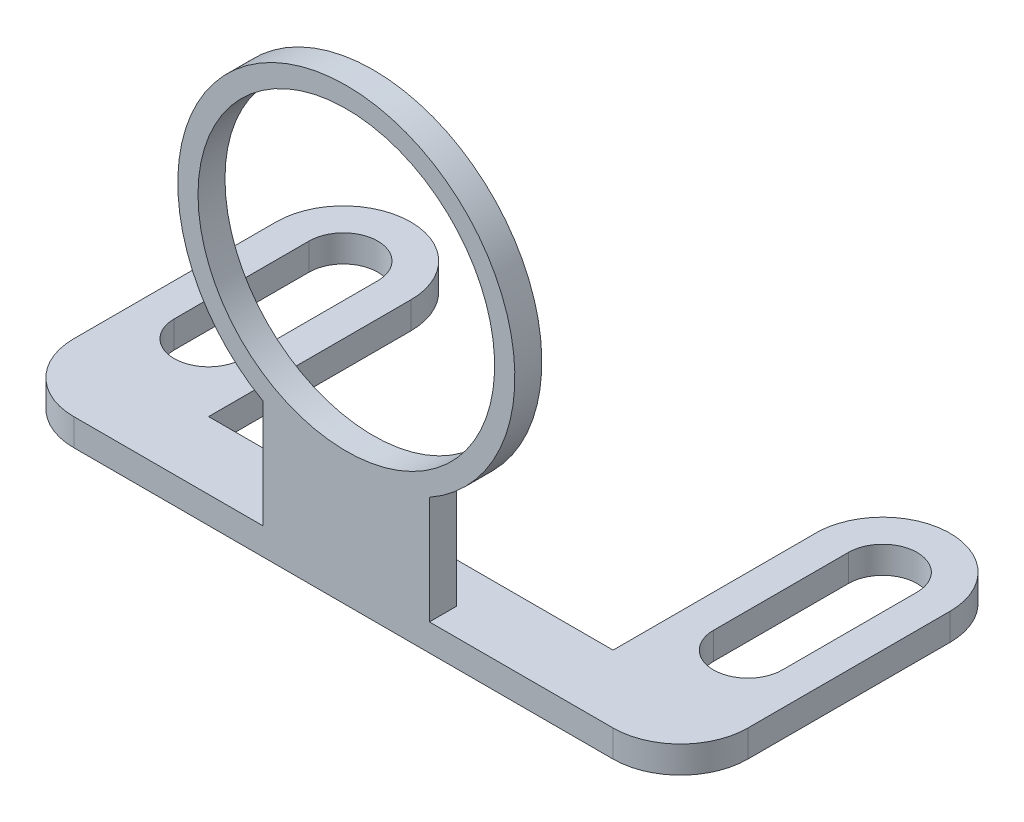
ISO-10303-21;
HEADER;
FILE_DESCRIPTION(('STEP AP214'),'2;1');
FILE_NAME('part.step','',(''),(''),'','','');
FILE_SCHEMA(('AUTOMOTIVE_DESIGN { 1 0 10303 214 1 1 1 1 }'));
ENDSEC;
DATA;
#1=APPLICATION_CONTEXT('core data for automotive mechanical design processes');
#2=APPLICATION_PROTOCOL_DEFINITION('international standard','automotive_design',2000,#1);
#3=PRODUCT_CONTEXT('',#1,'mechanical');
#4=PRODUCT('Part','Part','',(#3));
#5=PRODUCT_RELATED_PRODUCT_CATEGORY('part','',(#4));
#6=PRODUCT_DEFINITION_FORMATION('','',#4);
#7=PRODUCT_DEFINITION_CONTEXT('part definition',#1,'design');
#8=PRODUCT_DEFINITION('design','',#6,#7);
#9=PRODUCT_DEFINITION_SHAPE('','',#8);
#10=(LENGTH_UNIT() NAMED_UNIT(*) SI_UNIT(.MILLI.,.METRE.));
#11=(NAMED_UNIT(*) PLANE_ANGLE_UNIT() SI_UNIT($,.RADIAN.));
#12=(NAMED_UNIT(*) SI_UNIT($,.STERADIAN.) SOLID_ANGLE_UNIT());
#13=UNCERTAINTY_MEASURE_WITH_UNIT(LENGTH_MEASURE(1.E-05),#10,'distance_accuracy_value','');
#14=(GEOMETRIC_REPRESENTATION_CONTEXT(3) GLOBAL_UNCERTAINTY_ASSIGNED_CONTEXT((#13)) GLOBAL_UNIT_ASSIGNED_CONTEXT((#10,
#11,#12)) REPRESENTATION_CONTEXT('',''));
#15=CARTESIAN_POINT('',(0.,0.,0.));
#16=DIRECTION('',(0.,0.,1.));
#17=DIRECTION('',(1.,0.,0.));
#18=AXIS2_PLACEMENT_3D('',#15,#16,#17);
#19=CARTESIAN_POINT('',(-3.12539217756724,2.,0.));
#20=DIRECTION('',(1.,0.,0.));
#21=DIRECTION('',(0.,0.,-1.));
#22=AXIS2_PLACEMENT_3D('',#19,#20,#21);
#23=PLANE('',#22);
#24=DIRECTION('',(0.,0.,1.));
#25=VECTOR('',#24,1.);
#26=CARTESIAN_POINT('',(-3.12539217756724,0.,0.));
#27=LINE('',#26,#25);
#28=CARTESIAN_POINT('',(-3.12539217756726,0.,-25.));
#29=VERTEX_POINT('',#28);
#30=CARTESIAN_POINT('',(-3.12539217756725,0.,-15.));
#31=VERTEX_POINT('',#30);
#32=EDGE_CURVE('E247',#29,#31,#27,.T.);
#33=ORIENTED_EDGE('',*,*,#32,.T.);
#34=DIRECTION('',(0.,-1.,0.));
#35=VECTOR('',#34,1.);
#36=CARTESIAN_POINT('',(-3.12539217756725,2.,-15.));
#37=LINE('',#36,#35);
#38=CARTESIAN_POINT('',(-3.12539217756725,2.,-15.));
#39=VERTEX_POINT('',#38);
#40=EDGE_CURVE('E11',#39,#31,#37,.T.);
#41=ORIENTED_EDGE('',*,*,#40,.F.);
#42=DIRECTION('',(0.,0.,1.));
#43=VECTOR('',#42,1.);
#44=CARTESIAN_POINT('',(-3.12539217756724,2.,0.));
#45=LINE('',#44,#43);
#46=CARTESIAN_POINT('',(-3.12539217756726,2.,-25.));
#47=VERTEX_POINT('',#46);
#48=EDGE_CURVE('E186',#47,#39,#45,.T.);
#49=ORIENTED_EDGE('',*,*,#48,.F.);
#50=DIRECTION('',(0.,-1.,0.));
#51=VECTOR('',#50,1.);
#52=CARTESIAN_POINT('',(-3.12539217756726,2.,-25.));
#53=LINE('',#52,#51);
#54=EDGE_CURVE('E255',#47,#29,#53,.T.);
#55=ORIENTED_EDGE('',*,*,#54,.T.);
#56=EDGE_LOOP('',(#33,#41,#49,#55));
#57=FACE_BOUND('',#56,.T.);
#58=ADVANCED_FACE('F36',(#57),#23,.F.);
#59=CARTESIAN_POINT('',(-5.67539217756725,2.,-15.));
#60=DIRECTION('',(0.,-1.,0.));
#61=DIRECTION('',(0.,0.,-1.));
#62=AXIS2_PLACEMENT_3D('',#59,#60,#61);
#63=CYLINDRICAL_SURFACE('',#62,2.55);
#64=CARTESIAN_POINT('',(-5.67539217756725,0.,-15.));
#65=DIRECTION('',(0.,1.,0.));
#66=DIRECTION('',(0.,0.,1.));
#67=AXIS2_PLACEMENT_3D('',#64,#65,#66);
#68=CIRCLE('',#67,2.55);
#69=CARTESIAN_POINT('',(-8.22539217756726,0.,-15.));
#70=VERTEX_POINT('',#69);
#71=EDGE_CURVE('E192',#31,#70,#68,.F.);
#72=ORIENTED_EDGE('',*,*,#71,.T.);
#73=DIRECTION('',(0.,-1.,0.));
#74=VECTOR('',#73,1.);
#75=CARTESIAN_POINT('',(-8.22539217756726,2.,-15.));
#76=LINE('',#75,#74);
#77=CARTESIAN_POINT('',(-8.22539217756726,2.,-15.));
#78=VERTEX_POINT('',#77);
#79=EDGE_CURVE('E45',#78,#70,#76,.T.);
#80=ORIENTED_EDGE('',*,*,#79,.F.);
#81=CARTESIAN_POINT('',(-5.67539217756725,2.,-15.));
#82=DIRECTION('',(0.,1.,0.));
#83=DIRECTION('',(0.,0.,1.));
#84=AXIS2_PLACEMENT_3D('',#81,#82,#83);
#85=CIRCLE('',#84,2.55);
#86=EDGE_CURVE('E180',#39,#78,#85,.F.);
#87=ORIENTED_EDGE('',*,*,#86,.F.);
#88=ORIENTED_EDGE('',*,*,#40,.T.);
#89=EDGE_LOOP('',(#72,#80,#87,#88));
#90=FACE_BOUND('',#89,.T.);
#91=ADVANCED_FACE('F191',(#90),#63,.F.);
#92=CARTESIAN_POINT('',(-8.22539217756725,2.,0.));
#93=DIRECTION('',(1.,0.,0.));
#94=DIRECTION('',(0.,0.,-1.));
#95=AXIS2_PLACEMENT_3D('',#92,#93,#94);
#96=PLANE('',#95);
#97=DIRECTION('',(0.,0.,1.));
#98=VECTOR('',#97,1.);
#99=CARTESIAN_POINT('',(-8.22539217756725,0.,0.));
#100=LINE('',#99,#98);
#101=CARTESIAN_POINT('',(-8.22539217756727,0.,-25.));
#102=VERTEX_POINT('',#101);
#103=EDGE_CURVE('E251',#102,#70,#100,.T.);
#104=ORIENTED_EDGE('',*,*,#103,.F.);
#105=DIRECTION('',(0.,-1.,0.));
#106=VECTOR('',#105,1.);
#107=CARTESIAN_POINT('',(-8.22539217756727,2.,-25.));
#108=LINE('',#107,#106);
#109=CARTESIAN_POINT('',(-8.22539217756727,2.,-25.));
#110=VERTEX_POINT('',#109);
#111=EDGE_CURVE('E196',#110,#102,#108,.T.);
#112=ORIENTED_EDGE('',*,*,#111,.F.);
#113=DIRECTION('',(0.,0.,1.));
#114=VECTOR('',#113,1.);
#115=CARTESIAN_POINT('',(-8.22539217756725,2.,0.));
#116=LINE('',#115,#114);
#117=EDGE_CURVE('E184',#110,#78,#116,.T.);
#118=ORIENTED_EDGE('',*,*,#117,.T.);
#119=ORIENTED_EDGE('',*,*,#79,.T.);
#120=EDGE_LOOP('',(#104,#112,#118,#119));
#121=FACE_BOUND('',#120,.T.);
#122=ADVANCED_FACE('F198',(#121),#96,.T.);
#123=CARTESIAN_POINT('',(-45.6753921775673,2.,-15.));
#124=DIRECTION('',(0.,-1.,0.));
#125=DIRECTION('',(0.,0.,-1.));
#126=AXIS2_PLACEMENT_3D('',#123,#124,#125);
#127=CYLINDRICAL_SURFACE('',#126,2.55);
#128=CARTESIAN_POINT('',(-45.6753921775673,0.,-15.));
#129=DIRECTION('',(0.,1.,0.));
#130=DIRECTION('',(0.,0.,1.));
#131=AXIS2_PLACEMENT_3D('',#128,#129,#130);
#132=CIRCLE('',#131,2.55);
#133=CARTESIAN_POINT('',(-48.2253921775673,0.,-15.));
#134=VERTEX_POINT('',#133);
#135=CARTESIAN_POINT('',(-43.1253921775673,0.,-15.));
#136=VERTEX_POINT('',#135);
#137=EDGE_CURVE('E235',#134,#136,#132,.T.);
#138=ORIENTED_EDGE('',*,*,#137,.F.);
#139=DIRECTION('',(0.,-1.,0.));
#140=VECTOR('',#139,1.);
#141=CARTESIAN_POINT('',(-48.2253921775673,2.,-15.));
#142=LINE('',#141,#140);
#143=CARTESIAN_POINT('',(-48.2253921775673,2.,-15.));
#144=VERTEX_POINT('',#143);
#145=EDGE_CURVE('E257',#144,#134,#142,.T.);
#146=ORIENTED_EDGE('',*,*,#145,.F.);
#147=CARTESIAN_POINT('',(-45.6753921775673,2.,-15.));
#148=DIRECTION('',(0.,1.,0.));
#149=DIRECTION('',(0.,0.,1.));
#150=AXIS2_PLACEMENT_3D('',#147,#148,#149);
#151=CIRCLE('',#150,2.55);
#152=CARTESIAN_POINT('',(-43.1253921775673,2.,-15.));
#153=VERTEX_POINT('',#152);
#154=EDGE_CURVE('E317',#144,#153,#151,.T.);
#155=ORIENTED_EDGE('',*,*,#154,.T.);
#156=DIRECTION('',(0.,-1.,0.));
#157=VECTOR('',#156,1.);
#158=CARTESIAN_POINT('',(-43.1253921775673,2.,-15.));
#159=LINE('',#158,#157);
#160=EDGE_CURVE('E259',#153,#136,#159,.T.);
#161=ORIENTED_EDGE('',*,*,#160,.T.);
#162=EDGE_LOOP('',(#138,#146,#155,#161));
#163=FACE_BOUND('',#162,.T.);
#164=ADVANCED_FACE('F338',(#163),#127,.F.);
#165=CARTESIAN_POINT('',(-48.2253921775673,2.,0.));
#166=DIRECTION('',(1.,0.,0.));
#167=DIRECTION('',(0.,0.,-1.));
#168=AXIS2_PLACEMENT_3D('',#165,#166,#167);
#169=PLANE('',#168);
#170=DIRECTION('',(0.,0.,1.));
#171=VECTOR('',#170,1.);
#172=CARTESIAN_POINT('',(-48.2253921775673,0.,0.));
#173=LINE('',#172,#171);
#174=CARTESIAN_POINT('',(-48.2253921775673,0.,-25.));
#175=VERTEX_POINT('',#174);
#176=EDGE_CURVE('E238',#175,#134,#173,.T.);
#177=ORIENTED_EDGE('',*,*,#176,.F.);
#178=DIRECTION('',(0.,-1.,0.));
#179=VECTOR('',#178,1.);
#180=CARTESIAN_POINT('',(-48.2253921775673,2.,-25.));
#181=LINE('',#180,#179);
#182=CARTESIAN_POINT('',(-48.2253921775673,2.,-25.));
#183=VERTEX_POINT('',#182);
#184=EDGE_CURVE('E264',#183,#175,#181,.T.);
#185=ORIENTED_EDGE('',*,*,#184,.F.);
#186=DIRECTION('',(0.,0.,1.));
#187=VECTOR('',#186,1.);
#188=CARTESIAN_POINT('',(-48.2253921775673,2.,0.));
#189=LINE('',#188,#187);
#190=EDGE_CURVE('E320',#183,#144,#189,.T.);
#191=ORIENTED_EDGE('',*,*,#190,.T.);
#192=ORIENTED_EDGE('',*,*,#145,.T.);
#193=EDGE_LOOP('',(#177,#185,#191,#192));
#194=FACE_BOUND('',#193,.T.);
#195=ADVANCED_FACE('F341',(#194),#169,.T.);
#196=CARTESIAN_POINT('',(-45.6753921775673,2.,-25.));
#197=DIRECTION('',(0.,-1.,0.));
#198=DIRECTION('',(0.,0.,-1.));
#199=AXIS2_PLACEMENT_3D('',#196,#197,#198);
#200=CYLINDRICAL_SURFACE('',#199,2.55);
#201=CARTESIAN_POINT('',(-45.6753921775673,0.,-25.));
#202=DIRECTION('',(0.,1.,0.));
#203=DIRECTION('',(0.,0.,1.));
#204=AXIS2_PLACEMENT_3D('',#201,#202,#203);
#205=CIRCLE('',#204,2.55);
#206=CARTESIAN_POINT('',(-43.1253921775673,0.,-25.));
#207=VERTEX_POINT('',#206);
#208=EDGE_CURVE('E241',#207,#175,#205,.T.);
#209=ORIENTED_EDGE('',*,*,#208,.F.);
#210=DIRECTION('',(0.,-1.,0.));
#211=VECTOR('',#210,1.);
#212=CARTESIAN_POINT('',(-43.1253921775673,2.,-25.));
#213=LINE('',#212,#211);
#214=CARTESIAN_POINT('',(-43.1253921775673,2.,-25.));
#215=VERTEX_POINT('',#214);
#216=EDGE_CURVE('E261',#215,#207,#213,.T.);
#217=ORIENTED_EDGE('',*,*,#216,.F.);
#218=CARTESIAN_POINT('',(-45.6753921775673,2.,-25.));
#219=DIRECTION('',(0.,1.,0.));
#220=DIRECTION('',(0.,0.,1.));
#221=AXIS2_PLACEMENT_3D('',#218,#219,#220);
#222=CIRCLE('',#221,2.55);
#223=EDGE_CURVE('E323',#215,#183,#222,.T.);
#224=ORIENTED_EDGE('',*,*,#223,.T.);
#225=ORIENTED_EDGE('',*,*,#184,.T.);
#226=EDGE_LOOP('',(#209,#217,#224,#225));
#227=FACE_BOUND('',#226,.T.);
#228=ADVANCED_FACE('F344',(#227),#200,.F.);
#229=CARTESIAN_POINT('',(-45.6753921775673,2.,-9.99999999999999));
#230=DIRECTION('',(0.,-1.,0.));
#231=DIRECTION('',(0.,0.,-1.));
#232=AXIS2_PLACEMENT_3D('',#229,#230,#231);
#233=CYLINDRICAL_SURFACE('',#232,5.);
#234=CARTESIAN_POINT('',(-45.6753921775673,0.,-9.99999999999999));
#235=DIRECTION('',(0.,1.,0.));
#236=DIRECTION('',(0.,0.,1.));
#237=AXIS2_PLACEMENT_3D('',#234,#235,#236);
#238=CIRCLE('',#237,5.);
#239=CARTESIAN_POINT('',(-45.6753921775673,0.,-4.99999999999999));
#240=VERTEX_POINT('',#239);
#241=CARTESIAN_POINT('',(-50.6753921775673,0.,-9.99999999999999));
#242=VERTEX_POINT('',#241);
#243=EDGE_CURVE('E204',#240,#242,#238,.F.);
#244=ORIENTED_EDGE('',*,*,#243,.F.);
#245=DIRECTION('',(0.,-1.,0.));
#246=VECTOR('',#245,1.);
#247=CARTESIAN_POINT('',(-45.6753921775673,2.,-4.99999999999999));
#248=LINE('',#247,#246);
#249=CARTESIAN_POINT('',(-45.6753921775673,2.,-4.99999999999999));
#250=VERTEX_POINT('',#249);
#251=EDGE_CURVE('E262',#250,#240,#248,.T.);
#252=ORIENTED_EDGE('',*,*,#251,.F.);
#253=CARTESIAN_POINT('',(-45.6753921775673,2.,-9.99999999999999));
#254=DIRECTION('',(0.,1.,0.));
#255=DIRECTION('',(0.,0.,1.));
#256=AXIS2_PLACEMENT_3D('',#253,#254,#255);
#257=CIRCLE('',#256,5.);
#258=CARTESIAN_POINT('',(-50.6753921775673,2.,-9.99999999999999));
#259=VERTEX_POINT('',#258);
#260=EDGE_CURVE('E254',#250,#259,#257,.F.);
#261=ORIENTED_EDGE('',*,*,#260,.T.);
#262=DIRECTION('',(0.,-1.,0.));
#263=VECTOR('',#262,1.);
#264=CARTESIAN_POINT('',(-50.6753921775673,2.,-9.99999999999999));
#265=LINE('',#264,#263);
#266=EDGE_CURVE('E200',#259,#242,#265,.T.);
#267=ORIENTED_EDGE('',*,*,#266,.T.);
#268=EDGE_LOOP('',(#244,#252,#261,#267));
#269=FACE_BOUND('',#268,.T.);
#270=ADVANCED_FACE('F38',(#269),#233,.T.);
#271=CARTESIAN_POINT('',(0.,2.,-5.));
#272=DIRECTION('',(0.,0.,1.));
#273=DIRECTION('',(1.,0.,0.));
#274=AXIS2_PLACEMENT_3D('',#271,#272,#273);
#275=PLANE('',#274);
#276=DIRECTION('',(-1.,0.,0.));
#277=VECTOR('',#276,1.);
#278=CARTESIAN_POINT('',(0.,0.,-5.));
#279=LINE('',#278,#277);
#280=CARTESIAN_POINT('',(-5.67539217756727,0.,-5.));
#281=VERTEX_POINT('',#280);
#282=EDGE_CURVE('E207',#281,#240,#279,.T.);
#283=ORIENTED_EDGE('',*,*,#282,.F.);
#284=DIRECTION('',(0.,-1.,0.));
#285=VECTOR('',#284,1.);
#286=CARTESIAN_POINT('',(-5.67539217756727,2.,-5.));
#287=LINE('',#286,#285);
#288=CARTESIAN_POINT('',(-5.67539217756727,2.,-5.));
#289=VERTEX_POINT('',#288);
#290=EDGE_CURVE('E282',#289,#281,#287,.T.);
#291=ORIENTED_EDGE('',*,*,#290,.F.);
#292=DIRECTION('',(-1.,0.,0.));
#293=VECTOR('',#292,1.);
#294=CARTESIAN_POINT('',(0.,2.,-5.));
#295=LINE('',#294,#293);
#296=CARTESIAN_POINT('',(-19.2970374134388,2.,-5.));
#297=VERTEX_POINT('',#296);
#298=EDGE_CURVE('E285',#289,#297,#295,.T.);
#299=ORIENTED_EDGE('',*,*,#298,.T.);
#300=DIRECTION('',(0.,-1.,0.));
#301=VECTOR('',#300,1.);
#302=CARTESIAN_POINT('',(-19.2970374134388,10.004378208322,-5.));
#303=LINE('',#302,#301);
#304=CARTESIAN_POINT('',(-19.2970374134388,10.004378208322,-5.));
#305=VERTEX_POINT('',#304);
#306=EDGE_CURVE('E53',#305,#297,#303,.T.);
#307=ORIENTED_EDGE('',*,*,#306,.F.);
#308=CARTESIAN_POINT('',(-25.4596945631998,20.8796555314297,-5.));
#309=DIRECTION('',(0.,0.,-1.));
#310=DIRECTION('',(-1.,0.,0.));
#311=AXIS2_PLACEMENT_3D('',#308,#309,#310);
#312=CIRCLE('',#311,12.5);
#313=CARTESIAN_POINT('',(-31.6223517129608,10.004378208322,-5.));
#314=VERTEX_POINT('',#313);
#315=EDGE_CURVE('E424',#314,#305,#312,.T.);
#316=ORIENTED_EDGE('',*,*,#315,.F.);
#317=DIRECTION('',(0.,1.,0.));
#318=VECTOR('',#317,1.);
#319=CARTESIAN_POINT('',(-31.6223517129608,10.004378208322,-5.));
#320=LINE('',#319,#318);
#321=CARTESIAN_POINT('',(-31.6223517129608,2.,-5.));
#322=VERTEX_POINT('',#321);
#323=EDGE_CURVE('E431',#322,#314,#320,.T.);
#324=ORIENTED_EDGE('',*,*,#323,.F.);
#325=EDGE_CURVE('E133',#322,#250,#295,.T.);
#326=ORIENTED_EDGE('',*,*,#325,.T.);
#327=ORIENTED_EDGE('',*,*,#251,.T.);
#328=EDGE_LOOP('',(#283,#291,#299,#307,#316,#324,#326,#327));
#329=FACE_BOUND('',#328,.T.);
#330=CARTESIAN_POINT('',(-25.4596945631998,20.8796555314297,-5.));
#331=DIRECTION('',(0.,0.,-1.));
#332=DIRECTION('',(-1.,0.,0.));
#333=AXIS2_PLACEMENT_3D('',#330,#331,#332);
#334=CIRCLE('',#333,11.);
#335=CARTESIAN_POINT('',(-36.4596945631998,20.8796555314297,-5.));
#336=VERTEX_POINT('',#335);
#337=EDGE_CURVE('E419',#336,#336,#334,.T.);
#338=ORIENTED_EDGE('',*,*,#337,.T.);
#339=EDGE_LOOP('',(#338));
#340=FACE_BOUND('',#339,.T.);
#341=ADVANCED_FACE('F408',(#329,#340),#275,.T.);
#342=CARTESIAN_POINT('',(-5.67539217756727,2.,-10.));
#343=DIRECTION('',(0.,-1.,0.));
#344=DIRECTION('',(0.,0.,-1.));
#345=AXIS2_PLACEMENT_3D('',#342,#343,#344);
#346=CYLINDRICAL_SURFACE('',#345,5.);
#347=CARTESIAN_POINT('',(-5.67539217756727,0.,-10.));
#348=DIRECTION('',(0.,1.,0.));
#349=DIRECTION('',(0.,0.,1.));
#350=AXIS2_PLACEMENT_3D('',#347,#348,#349);
#351=CIRCLE('',#350,5.);
#352=CARTESIAN_POINT('',(-0.675392177567271,0.,-10.));
#353=VERTEX_POINT('',#352);
#354=EDGE_CURVE('E211',#353,#281,#351,.F.);
#355=ORIENTED_EDGE('',*,*,#354,.F.);
#356=DIRECTION('',(0.,-1.,0.));
#357=VECTOR('',#356,1.);
#358=CARTESIAN_POINT('',(-0.675392177567271,2.,-10.));
#359=LINE('',#358,#357);
#360=CARTESIAN_POINT('',(-0.675392177567271,2.,-10.));
#361=VERTEX_POINT('',#360);
#362=EDGE_CURVE('E280',#361,#353,#359,.T.);
#363=ORIENTED_EDGE('',*,*,#362,.F.);
#364=CARTESIAN_POINT('',(-5.67539217756727,2.,-10.));
#365=DIRECTION('',(0.,1.,0.));
#366=DIRECTION('',(0.,0.,1.));
#367=AXIS2_PLACEMENT_3D('',#364,#365,#366);
#368=CIRCLE('',#367,5.);
#369=EDGE_CURVE('E289',#361,#289,#368,.F.);
#370=ORIENTED_EDGE('',*,*,#369,.T.);
#371=ORIENTED_EDGE('',*,*,#290,.T.);
#372=EDGE_LOOP('',(#355,#363,#370,#371));
#373=FACE_BOUND('',#372,.T.);
#374=ADVANCED_FACE('F405',(#373),#346,.T.);
#375=CARTESIAN_POINT('',(-0.67539217756727,2.,0.));
#376=DIRECTION('',(1.,0.,0.));
#377=DIRECTION('',(0.,0.,-1.));
#378=AXIS2_PLACEMENT_3D('',#375,#376,#377);
#379=PLANE('',#378);
#380=DIRECTION('',(0.,0.,1.));
#381=VECTOR('',#380,1.);
#382=CARTESIAN_POINT('',(-0.67539217756727,0.,0.));
#383=LINE('',#382,#381);
#384=CARTESIAN_POINT('',(-0.675392177567273,0.,-25.));
#385=VERTEX_POINT('',#384);
#386=EDGE_CURVE('E214',#385,#353,#383,.T.);
#387=ORIENTED_EDGE('',*,*,#386,.F.);
#388=DIRECTION('',(0.,-1.,0.));
#389=VECTOR('',#388,1.);
#390=CARTESIAN_POINT('',(-0.675392177567273,2.,-25.));
#391=LINE('',#390,#389);
#392=CARTESIAN_POINT('',(-0.675392177567273,2.,-25.));
#393=VERTEX_POINT('',#392);
#394=EDGE_CURVE('E278',#393,#385,#391,.T.);
#395=ORIENTED_EDGE('',*,*,#394,.F.);
#396=DIRECTION('',(0.,0.,1.));
#397=VECTOR('',#396,1.);
#398=CARTESIAN_POINT('',(-0.67539217756727,2.,0.));
#399=LINE('',#398,#397);
#400=EDGE_CURVE('E298',#393,#361,#399,.T.);
#401=ORIENTED_EDGE('',*,*,#400,.T.);
#402=ORIENTED_EDGE('',*,*,#362,.T.);
#403=EDGE_LOOP('',(#387,#395,#401,#402));
#404=FACE_BOUND('',#403,.T.);
#405=ADVANCED_FACE('F401',(#404),#379,.T.);
#406=CARTESIAN_POINT('',(-5.68093562292675,2.,-25.));
#407=DIRECTION('',(0.,-1.,0.));
#408=DIRECTION('',(0.,0.,-1.));
#409=AXIS2_PLACEMENT_3D('',#406,#407,#408);
#410=CYLINDRICAL_SURFACE('',#409,5.00554344535948);
#411=CARTESIAN_POINT('',(-5.68093562292675,0.,-25.));
#412=DIRECTION('',(0.,1.,0.));
#413=DIRECTION('',(0.,0.,1.));
#414=AXIS2_PLACEMENT_3D('',#411,#412,#413);
#415=CIRCLE('',#414,5.00554344535948);
#416=CARTESIAN_POINT('',(-10.6753921775673,0.,-24.6670301707519));
#417=VERTEX_POINT('',#416);
#418=EDGE_CURVE('E217',#385,#417,#415,.T.);
#419=ORIENTED_EDGE('',*,*,#418,.T.);
#420=DIRECTION('',(0.,-1.,0.));
#421=VECTOR('',#420,1.);
#422=CARTESIAN_POINT('',(-10.6753921775673,2.,-24.6670301707519));
#423=LINE('',#422,#421);
#424=CARTESIAN_POINT('',(-10.6753921775673,2.,-24.6670301707519));
#425=VERTEX_POINT('',#424);
#426=EDGE_CURVE('E276',#425,#417,#423,.T.);
#427=ORIENTED_EDGE('',*,*,#426,.F.);
#428=CARTESIAN_POINT('',(-5.68093562292675,2.,-25.));
#429=DIRECTION('',(0.,1.,0.));
#430=DIRECTION('',(0.,0.,1.));
#431=AXIS2_PLACEMENT_3D('',#428,#429,#430);
#432=CIRCLE('',#431,5.00554344535948);
#433=EDGE_CURVE('E301',#393,#425,#432,.T.);
#434=ORIENTED_EDGE('',*,*,#433,.F.);
#435=ORIENTED_EDGE('',*,*,#394,.T.);
#436=EDGE_LOOP('',(#419,#427,#434,#435));
#437=FACE_BOUND('',#436,.T.);
#438=ADVANCED_FACE('F397',(#437),#410,.T.);
#439=CARTESIAN_POINT('',(-10.6753921775673,2.,0.));
#440=DIRECTION('',(-1.,0.,0.));
#441=DIRECTION('',(0.,0.,1.));
#442=AXIS2_PLACEMENT_3D('',#439,#440,#441);
#443=PLANE('',#442);
#444=DIRECTION('',(0.,0.,-1.));
#445=VECTOR('',#444,1.);
#446=CARTESIAN_POINT('',(-10.6753921775673,0.,0.));
#447=LINE('',#446,#445);
#448=CARTESIAN_POINT('',(-10.6753921775673,0.,-10.));
#449=VERTEX_POINT('',#448);
#450=EDGE_CURVE('E220',#449,#417,#447,.T.);
#451=ORIENTED_EDGE('',*,*,#450,.F.);
#452=DIRECTION('',(0.,-1.,0.));
#453=VECTOR('',#452,1.);
#454=CARTESIAN_POINT('',(-10.6753921775673,2.,-10.));
#455=LINE('',#454,#453);
#456=CARTESIAN_POINT('',(-10.6753921775673,2.,-10.));
#457=VERTEX_POINT('',#456);
#458=EDGE_CURVE('E274',#457,#449,#455,.T.);
#459=ORIENTED_EDGE('',*,*,#458,.F.);
#460=DIRECTION('',(0.,0.,-1.));
#461=VECTOR('',#460,1.);
#462=CARTESIAN_POINT('',(-10.6753921775673,2.,0.));
#463=LINE('',#462,#461);
#464=EDGE_CURVE('E303',#457,#425,#463,.T.);
#465=ORIENTED_EDGE('',*,*,#464,.T.);
#466=ORIENTED_EDGE('',*,*,#426,.T.);
#467=EDGE_LOOP('',(#451,#459,#465,#466));
#468=FACE_BOUND('',#467,.T.);
#469=ADVANCED_FACE('F393',(#468),#443,.T.);
#470=CARTESIAN_POINT('',(0.,2.,-10.));
#471=DIRECTION('',(0.,0.,-1.));
#472=DIRECTION('',(-1.,0.,0.));
#473=AXIS2_PLACEMENT_3D('',#470,#471,#472);
#474=PLANE('',#473);
#475=DIRECTION('',(1.,0.,0.));
#476=VECTOR('',#475,1.);
#477=CARTESIAN_POINT('',(0.,0.,-10.));
#478=LINE('',#477,#476);
#479=CARTESIAN_POINT('',(-40.6753921775673,0.,-10.));
#480=VERTEX_POINT('',#479);
#481=EDGE_CURVE('E223',#480,#449,#478,.T.);
#482=ORIENTED_EDGE('',*,*,#481,.F.);
#483=DIRECTION('',(0.,-1.,0.));
#484=VECTOR('',#483,1.);
#485=CARTESIAN_POINT('',(-40.6753921775673,2.,-10.));
#486=LINE('',#485,#484);
#487=CARTESIAN_POINT('',(-40.6753921775673,2.,-10.));
#488=VERTEX_POINT('',#487);
#489=EDGE_CURVE('E272',#488,#480,#486,.T.);
#490=ORIENTED_EDGE('',*,*,#489,.F.);
#491=DIRECTION('',(1.,0.,0.));
#492=VECTOR('',#491,1.);
#493=CARTESIAN_POINT('',(0.,2.,-10.));
#494=LINE('',#493,#492);
#495=EDGE_CURVE('E306',#488,#457,#494,.T.);
#496=ORIENTED_EDGE('',*,*,#495,.T.);
#497=ORIENTED_EDGE('',*,*,#458,.T.);
#498=EDGE_LOOP('',(#482,#490,#496,#497));
#499=FACE_BOUND('',#498,.T.);
#500=ADVANCED_FACE('F389',(#499),#474,.T.);
#501=CARTESIAN_POINT('',(-40.6753921775673,2.,0.));
#502=DIRECTION('',(1.,0.,0.));
#503=DIRECTION('',(0.,0.,-1.));
#504=AXIS2_PLACEMENT_3D('',#501,#502,#503);
#505=PLANE('',#504);
#506=DIRECTION('',(0.,0.,1.));
#507=VECTOR('',#506,1.);
#508=CARTESIAN_POINT('',(-40.6753921775673,0.,0.));
#509=LINE('',#508,#507);
#510=CARTESIAN_POINT('',(-40.6753921775673,0.,-25.));
#511=VERTEX_POINT('',#510);
#512=EDGE_CURVE('E226',#511,#480,#509,.T.);
#513=ORIENTED_EDGE('',*,*,#512,.F.);
#514=DIRECTION('',(0.,-1.,0.));
#515=VECTOR('',#514,1.);
#516=CARTESIAN_POINT('',(-40.6753921775673,2.,-25.));
#517=LINE('',#516,#515);
#518=CARTESIAN_POINT('',(-40.6753921775673,2.,-25.));
#519=VERTEX_POINT('',#518);
#520=EDGE_CURVE('E270',#519,#511,#517,.T.);
#521=ORIENTED_EDGE('',*,*,#520,.F.);
#522=DIRECTION('',(0.,0.,1.));
#523=VECTOR('',#522,1.);
#524=CARTESIAN_POINT('',(-40.6753921775673,2.,0.));
#525=LINE('',#524,#523);
#526=EDGE_CURVE('E309',#519,#488,#525,.T.);
#527=ORIENTED_EDGE('',*,*,#526,.T.);
#528=ORIENTED_EDGE('',*,*,#489,.T.);
#529=EDGE_LOOP('',(#513,#521,#527,#528));
#530=FACE_BOUND('',#529,.T.);
#531=ADVANCED_FACE('F385',(#530),#505,.T.);
#532=CARTESIAN_POINT('',(-45.6753921775673,2.,-25.));
#533=DIRECTION('',(0.,-1.,0.));
#534=DIRECTION('',(0.,0.,-1.));
#535=AXIS2_PLACEMENT_3D('',#532,#533,#534);
#536=CYLINDRICAL_SURFACE('',#535,5.);
#537=CARTESIAN_POINT('',(-45.6753921775673,0.,-25.));
#538=DIRECTION('',(0.,1.,0.));
#539=DIRECTION('',(0.,0.,1.));
#540=AXIS2_PLACEMENT_3D('',#537,#538,#539);
#541=CIRCLE('',#540,5.);
#542=CARTESIAN_POINT('',(-50.6753921775673,0.,-25.));
#543=VERTEX_POINT('',#542);
#544=EDGE_CURVE('E229',#511,#543,#541,.T.);
#545=ORIENTED_EDGE('',*,*,#544,.T.);
#546=DIRECTION('',(0.,-1.,0.));
#547=VECTOR('',#546,1.);
#548=CARTESIAN_POINT('',(-50.6753921775673,2.,-25.));
#549=LINE('',#548,#547);
#550=CARTESIAN_POINT('',(-50.6753921775673,2.,-25.));
#551=VERTEX_POINT('',#550);
#552=EDGE_CURVE('E268',#551,#543,#549,.T.);
#553=ORIENTED_EDGE('',*,*,#552,.F.);
#554=CARTESIAN_POINT('',(-45.6753921775673,2.,-25.));
#555=DIRECTION('',(0.,1.,0.));
#556=DIRECTION('',(0.,0.,1.));
#557=AXIS2_PLACEMENT_3D('',#554,#555,#556);
#558=CIRCLE('',#557,5.);
#559=EDGE_CURVE('E312',#519,#551,#558,.T.);
#560=ORIENTED_EDGE('',*,*,#559,.F.);
#561=ORIENTED_EDGE('',*,*,#520,.T.);
#562=EDGE_LOOP('',(#545,#553,#560,#561));
#563=FACE_BOUND('',#562,.T.);
#564=ADVANCED_FACE('F376',(#563),#536,.T.);
#565=CARTESIAN_POINT('',(-43.1253921775673,2.,0.));
#566=DIRECTION('',(1.,0.,0.));
#567=DIRECTION('',(0.,0.,-1.));
#568=AXIS2_PLACEMENT_3D('',#565,#566,#567);
#569=PLANE('',#568);
#570=DIRECTION('',(0.,0.,1.));
#571=VECTOR('',#570,1.);
#572=CARTESIAN_POINT('',(-43.1253921775673,0.,0.));
#573=LINE('',#572,#571);
#574=EDGE_CURVE('E244',#207,#136,#573,.T.);
#575=ORIENTED_EDGE('',*,*,#574,.T.);
#576=ORIENTED_EDGE('',*,*,#160,.F.);
#577=DIRECTION('',(0.,0.,1.));
#578=VECTOR('',#577,1.);
#579=CARTESIAN_POINT('',(-43.1253921775673,2.,0.));
#580=LINE('',#579,#578);
#581=EDGE_CURVE('E326',#215,#153,#580,.T.);
#582=ORIENTED_EDGE('',*,*,#581,.F.);
#583=ORIENTED_EDGE('',*,*,#216,.T.);
#584=EDGE_LOOP('',(#575,#576,#582,#583));
#585=FACE_BOUND('',#584,.T.);
#586=ADVANCED_FACE('F334',(#585),#569,.F.);
#587=CARTESIAN_POINT('',(-50.6753921775673,2.,0.));
#588=DIRECTION('',(-1.,0.,0.));
#589=DIRECTION('',(0.,0.,1.));
#590=AXIS2_PLACEMENT_3D('',#587,#588,#589);
#591=PLANE('',#590);
#592=DIRECTION('',(0.,0.,-1.));
#593=VECTOR('',#592,1.);
#594=CARTESIAN_POINT('',(-50.6753921775673,0.,0.));
#595=LINE('',#594,#593);
#596=EDGE_CURVE('E232',#242,#543,#595,.T.);
#597=ORIENTED_EDGE('',*,*,#596,.F.);
#598=ORIENTED_EDGE('',*,*,#266,.F.);
#599=DIRECTION('',(0.,0.,-1.));
#600=VECTOR('',#599,1.);
#601=CARTESIAN_POINT('',(-50.6753921775673,2.,0.));
#602=LINE('',#601,#600);
#603=EDGE_CURVE('E314',#259,#551,#602,.T.);
#604=ORIENTED_EDGE('',*,*,#603,.T.);
#605=ORIENTED_EDGE('',*,*,#552,.T.);
#606=EDGE_LOOP('',(#597,#598,#604,#605));
#607=FACE_BOUND('',#606,.T.);
#608=ADVANCED_FACE('F356',(#607),#591,.T.);
#609=CARTESIAN_POINT('',(-5.67539217756726,2.,-25.));
#610=DIRECTION('',(0.,-1.,0.));
#611=DIRECTION('',(0.,0.,-1.));
#612=AXIS2_PLACEMENT_3D('',#609,#610,#611);
#613=CYLINDRICAL_SURFACE('',#612,2.55);
#614=CARTESIAN_POINT('',(-5.67539217756726,0.,-25.));
#615=DIRECTION('',(0.,1.,0.));
#616=DIRECTION('',(0.,0.,1.));
#617=AXIS2_PLACEMENT_3D('',#614,#615,#616);
#618=CIRCLE('',#617,2.55);
#619=EDGE_CURVE('E125',#102,#29,#618,.F.);
#620=ORIENTED_EDGE('',*,*,#619,.T.);
#621=ORIENTED_EDGE('',*,*,#54,.F.);
#622=CARTESIAN_POINT('',(-5.67539217756726,2.,-25.));
#623=DIRECTION('',(0.,1.,0.));
#624=DIRECTION('',(0.,0.,1.));
#625=AXIS2_PLACEMENT_3D('',#622,#623,#624);
#626=CIRCLE('',#625,2.55);
#627=EDGE_CURVE('E62',#110,#47,#626,.F.);
#628=ORIENTED_EDGE('',*,*,#627,.F.);
#629=ORIENTED_EDGE('',*,*,#111,.T.);
#630=EDGE_LOOP('',(#620,#621,#628,#629));
#631=FACE_BOUND('',#630,.T.);
#632=ADVANCED_FACE('F354',(#631),#613,.F.);
#633=CARTESIAN_POINT('',(0.,2.,0.));
#634=DIRECTION('',(0.,1.,0.));
#635=DIRECTION('',(0.,0.,1.));
#636=AXIS2_PLACEMENT_3D('',#633,#634,#635);
#637=PLANE('',#636);
#638=DIRECTION('',(0.,0.,1.));
#639=VECTOR('',#638,1.);
#640=CARTESIAN_POINT('',(-31.6223517129608,2.,-7.));
#641=LINE('',#640,#639);
#642=CARTESIAN_POINT('',(-31.6223517129608,2.,-7.));
#643=VERTEX_POINT('',#642);
#644=EDGE_CURVE('E445',#643,#322,#641,.T.);
#645=ORIENTED_EDGE('',*,*,#644,.F.);
#646=DIRECTION('',(-1.,0.,0.));
#647=VECTOR('',#646,1.);
#648=CARTESIAN_POINT('',(-19.2970374134388,2.,-7.));
#649=LINE('',#648,#647);
#650=CARTESIAN_POINT('',(-19.2970374134388,2.,-7.));
#651=VERTEX_POINT('',#650);
#652=EDGE_CURVE('E434',#651,#643,#649,.T.);
#653=ORIENTED_EDGE('',*,*,#652,.F.);
#654=DIRECTION('',(0.,0.,1.));
#655=VECTOR('',#654,1.);
#656=CARTESIAN_POINT('',(-19.2970374134388,2.,-7.));
#657=LINE('',#656,#655);
#658=EDGE_CURVE('E447',#651,#297,#657,.T.);
#659=ORIENTED_EDGE('',*,*,#658,.T.);
#660=ORIENTED_EDGE('',*,*,#298,.F.);
#661=ORIENTED_EDGE('',*,*,#369,.F.);
#662=ORIENTED_EDGE('',*,*,#400,.F.);
#663=ORIENTED_EDGE('',*,*,#433,.T.);
#664=ORIENTED_EDGE('',*,*,#464,.F.);
#665=ORIENTED_EDGE('',*,*,#495,.F.);
#666=ORIENTED_EDGE('',*,*,#526,.F.);
#667=ORIENTED_EDGE('',*,*,#559,.T.);
#668=ORIENTED_EDGE('',*,*,#603,.F.);
#669=ORIENTED_EDGE('',*,*,#260,.F.);
#670=ORIENTED_EDGE('',*,*,#325,.F.);
#671=EDGE_LOOP('',(#645,#653,#659,#660,#661,#662,#663,#664,#665,#666,#667,#668,#669,#670));
#672=FACE_BOUND('',#671,.T.);
#673=ORIENTED_EDGE('',*,*,#154,.F.);
#674=ORIENTED_EDGE('',*,*,#190,.F.);
#675=ORIENTED_EDGE('',*,*,#223,.F.);
#676=ORIENTED_EDGE('',*,*,#581,.T.);
#677=EDGE_LOOP('',(#673,#674,#675,#676));
#678=FACE_BOUND('',#677,.T.);
#679=ORIENTED_EDGE('',*,*,#48,.T.);
#680=ORIENTED_EDGE('',*,*,#86,.T.);
#681=ORIENTED_EDGE('',*,*,#117,.F.);
#682=ORIENTED_EDGE('',*,*,#627,.T.);
#683=EDGE_LOOP('',(#679,#680,#681,#682));
#684=FACE_BOUND('',#683,.T.);
#685=ADVANCED_FACE('F182',(#672,#678,#684),#637,.T.);
#686=CARTESIAN_POINT('',(0.,0.,0.));
#687=DIRECTION('',(0.,1.,0.));
#688=DIRECTION('',(0.,0.,1.));
#689=AXIS2_PLACEMENT_3D('',#686,#687,#688);
#690=PLANE('',#689);
#691=ORIENTED_EDGE('',*,*,#243,.T.);
#692=ORIENTED_EDGE('',*,*,#596,.T.);
#693=ORIENTED_EDGE('',*,*,#544,.F.);
#694=ORIENTED_EDGE('',*,*,#512,.T.);
#695=ORIENTED_EDGE('',*,*,#481,.T.);
#696=ORIENTED_EDGE('',*,*,#450,.T.);
#697=ORIENTED_EDGE('',*,*,#418,.F.);
#698=ORIENTED_EDGE('',*,*,#386,.T.);
#699=ORIENTED_EDGE('',*,*,#354,.T.);
#700=ORIENTED_EDGE('',*,*,#282,.T.);
#701=EDGE_LOOP('',(#691,#692,#693,#694,#695,#696,#697,#698,#699,#700));
#702=FACE_BOUND('',#701,.T.);
#703=ORIENTED_EDGE('',*,*,#137,.T.);
#704=ORIENTED_EDGE('',*,*,#574,.F.);
#705=ORIENTED_EDGE('',*,*,#208,.T.);
#706=ORIENTED_EDGE('',*,*,#176,.T.);
#707=EDGE_LOOP('',(#703,#704,#705,#706));
#708=FACE_BOUND('',#707,.T.);
#709=ORIENTED_EDGE('',*,*,#32,.F.);
#710=ORIENTED_EDGE('',*,*,#619,.F.);
#711=ORIENTED_EDGE('',*,*,#103,.T.);
#712=ORIENTED_EDGE('',*,*,#71,.F.);
#713=EDGE_LOOP('',(#709,#710,#711,#712));
#714=FACE_BOUND('',#713,.T.);
#715=ADVANCED_FACE('F346',(#702,#708,#714),#690,.F.);
#716=CARTESIAN_POINT('',(-25.4596945631998,20.8796555314297,-7.));
#717=DIRECTION('',(0.,0.,-1.));
#718=DIRECTION('',(-1.,0.,0.));
#719=AXIS2_PLACEMENT_3D('',#716,#717,#718);
#720=PLANE('',#719);
#721=CARTESIAN_POINT('',(-25.4596945631998,20.8796555314297,-7.));
#722=DIRECTION('',(0.,0.,-1.));
#723=DIRECTION('',(-1.,0.,0.));
#724=AXIS2_PLACEMENT_3D('',#721,#722,#723);
#725=CIRCLE('',#724,12.5);
#726=CARTESIAN_POINT('',(-31.6223517129608,10.004378208322,-7.));
#727=VERTEX_POINT('',#726);
#728=CARTESIAN_POINT('',(-19.2970374134388,10.004378208322,-7.));
#729=VERTEX_POINT('',#728);
#730=EDGE_CURVE('E427',#727,#729,#725,.T.);
#731=ORIENTED_EDGE('',*,*,#730,.T.);
#732=DIRECTION('',(0.,-1.,0.));
#733=VECTOR('',#732,1.);
#734=CARTESIAN_POINT('',(-19.2970374134388,10.004378208322,-7.));
#735=LINE('',#734,#733);
#736=EDGE_CURVE('E430',#729,#651,#735,.T.);
#737=ORIENTED_EDGE('',*,*,#736,.T.);
#738=ORIENTED_EDGE('',*,*,#652,.T.);
#739=DIRECTION('',(0.,1.,0.));
#740=VECTOR('',#739,1.);
#741=CARTESIAN_POINT('',(-31.6223517129608,10.004378208322,-7.));
#742=LINE('',#741,#740);
#743=EDGE_CURVE('E437',#643,#727,#742,.T.);
#744=ORIENTED_EDGE('',*,*,#743,.T.);
#745=EDGE_LOOP('',(#731,#737,#738,#744));
#746=FACE_BOUND('',#745,.T.);
#747=CARTESIAN_POINT('',(-25.4596945631998,20.8796555314297,-7.));
#748=DIRECTION('',(0.,0.,-1.));
#749=DIRECTION('',(-1.,0.,0.));
#750=AXIS2_PLACEMENT_3D('',#747,#748,#749);
#751=CIRCLE('',#750,11.);
#752=CARTESIAN_POINT('',(-36.4596945631998,20.8796555314297,-7.));
#753=VERTEX_POINT('',#752);
#754=EDGE_CURVE('E421',#753,#753,#751,.T.);
#755=ORIENTED_EDGE('',*,*,#754,.F.);
#756=EDGE_LOOP('',(#755));
#757=FACE_BOUND('',#756,.T.);
#758=ADVANCED_FACE('F349',(#746,#757),#720,.T.);
#759=CARTESIAN_POINT('',(-25.4596945631998,20.8796555314297,-7.));
#760=DIRECTION('',(0.,0.,1.));
#761=DIRECTION('',(1.,0.,0.));
#762=AXIS2_PLACEMENT_3D('',#759,#760,#761);
#763=CYLINDRICAL_SURFACE('',#762,12.5);
#764=ORIENTED_EDGE('',*,*,#315,.T.);
#765=DIRECTION('',(0.,0.,1.));
#766=VECTOR('',#765,1.);
#767=CARTESIAN_POINT('',(-19.2970374134388,10.004378208322,-7.));
#768=LINE('',#767,#766);
#769=EDGE_CURVE('E208',#729,#305,#768,.T.);
#770=ORIENTED_EDGE('',*,*,#769,.F.);
#771=ORIENTED_EDGE('',*,*,#730,.F.);
#772=DIRECTION('',(0.,0.,1.));
#773=VECTOR('',#772,1.);
#774=CARTESIAN_POINT('',(-31.6223517129608,10.004378208322,-7.));
#775=LINE('',#774,#773);
#776=EDGE_CURVE('E440',#727,#314,#775,.T.);
#777=ORIENTED_EDGE('',*,*,#776,.T.);
#778=EDGE_LOOP('',(#764,#770,#771,#777));
#779=FACE_BOUND('',#778,.T.);
#780=ADVANCED_FACE('F466',(#779),#763,.T.);
#781=CARTESIAN_POINT('',(-19.2970374134388,10.004378208322,-7.));
#782=DIRECTION('',(-1.,0.,0.));
#783=DIRECTION('',(0.,0.,1.));
#784=AXIS2_PLACEMENT_3D('',#781,#782,#783);
#785=PLANE('',#784);
#786=ORIENTED_EDGE('',*,*,#306,.T.);
#787=ORIENTED_EDGE('',*,*,#658,.F.);
#788=ORIENTED_EDGE('',*,*,#736,.F.);
#789=ORIENTED_EDGE('',*,*,#769,.T.);
#790=EDGE_LOOP('',(#786,#787,#788,#789));
#791=FACE_BOUND('',#790,.T.);
#792=ADVANCED_FACE('F472',(#791),#785,.F.);
#793=CARTESIAN_POINT('',(-31.6223517129608,10.004378208322,-7.));
#794=DIRECTION('',(1.,0.,0.));
#795=DIRECTION('',(0.,0.,-1.));
#796=AXIS2_PLACEMENT_3D('',#793,#794,#795);
#797=PLANE('',#796);
#798=ORIENTED_EDGE('',*,*,#323,.T.);
#799=ORIENTED_EDGE('',*,*,#776,.F.);
#800=ORIENTED_EDGE('',*,*,#743,.F.);
#801=ORIENTED_EDGE('',*,*,#644,.T.);
#802=EDGE_LOOP('',(#798,#799,#800,#801));
#803=FACE_BOUND('',#802,.T.);
#804=ADVANCED_FACE('F458',(#803),#797,.F.);
#805=CARTESIAN_POINT('',(-25.4596945631998,20.8796555314297,-7.));
#806=DIRECTION('',(0.,0.,1.));
#807=DIRECTION('',(1.,0.,0.));
#808=AXIS2_PLACEMENT_3D('',#805,#806,#807);
#809=CYLINDRICAL_SURFACE('',#808,11.);
#810=ORIENTED_EDGE('',*,*,#754,.T.);
#811=EDGE_LOOP('',(#810));
#812=FACE_BOUND('',#811,.T.);
#813=ORIENTED_EDGE('',*,*,#337,.F.);
#814=EDGE_LOOP('',(#813));
#815=FACE_BOUND('',#814,.T.);
#816=ADVANCED_FACE('F507',(#812,#815),#809,.F.);
#817=CLOSED_SHELL('',(#58,#91,#122,#164,#195,#228,#270,#341,#374,#405,#438,#469,#500,#531,#564,
#586,#608,#632,#685,#715,#758,#780,#792,#804,#816));
#818=MANIFOLD_SOLID_BREP('B2',#817);
#819=ADVANCED_BREP_SHAPE_REPRESENTATION('',(#18,#818),#14);
#820=SHAPE_DEFINITION_REPRESENTATION(#9,#819);
ENDSEC;
END-ISO-10303-21;
